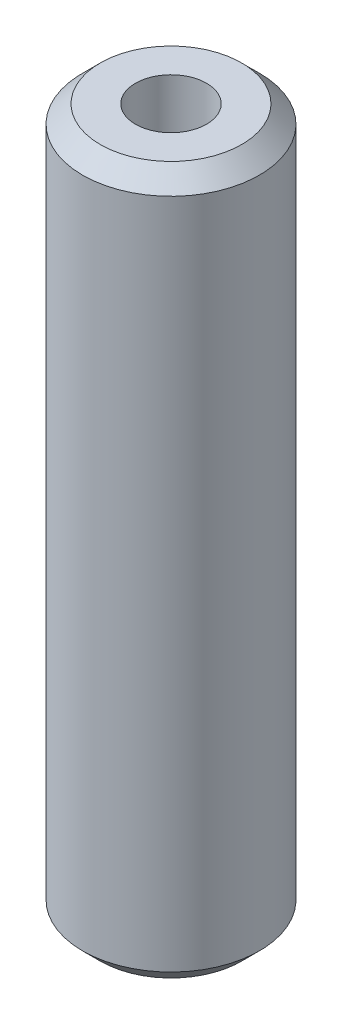
ISO-10303-21;
HEADER;
FILE_DESCRIPTION(('STEP AP214'),'2;1');
FILE_NAME('part.step','',(''),(''),'','','');
FILE_SCHEMA(('AUTOMOTIVE_DESIGN { 1 0 10303 214 1 1 1 1 }'));
ENDSEC;
DATA;
#1=APPLICATION_CONTEXT('core data for automotive mechanical design processes');
#2=APPLICATION_PROTOCOL_DEFINITION('international standard','automotive_design',2000,#1);
#3=PRODUCT_CONTEXT('',#1,'mechanical');
#4=PRODUCT('Part','Part','',(#3));
#5=PRODUCT_RELATED_PRODUCT_CATEGORY('part','',(#4));
#6=PRODUCT_DEFINITION_FORMATION('','',#4);
#7=PRODUCT_DEFINITION_CONTEXT('part definition',#1,'design');
#8=PRODUCT_DEFINITION('design','',#6,#7);
#9=PRODUCT_DEFINITION_SHAPE('','',#8);
#10=(LENGTH_UNIT() NAMED_UNIT(*) SI_UNIT(.MILLI.,.METRE.));
#11=(NAMED_UNIT(*) PLANE_ANGLE_UNIT() SI_UNIT($,.RADIAN.));
#12=(NAMED_UNIT(*) SI_UNIT($,.STERADIAN.) SOLID_ANGLE_UNIT());
#13=UNCERTAINTY_MEASURE_WITH_UNIT(LENGTH_MEASURE(1.E-05),#10,'distance_accuracy_value','');
#14=(GEOMETRIC_REPRESENTATION_CONTEXT(3) GLOBAL_UNCERTAINTY_ASSIGNED_CONTEXT((#13)) GLOBAL_UNIT_ASSIGNED_CONTEXT((#10,
#11,#12)) REPRESENTATION_CONTEXT('',''));
#15=CARTESIAN_POINT('',(0.,0.,0.));
#16=DIRECTION('',(0.,0.,1.));
#17=DIRECTION('',(1.,0.,0.));
#18=AXIS2_PLACEMENT_3D('',#15,#16,#17);
#19=CARTESIAN_POINT('',(0.,50.8,0.));
#20=DIRECTION('',(0.,-1.,0.));
#21=DIRECTION('',(0.,0.,-1.));
#22=AXIS2_PLACEMENT_3D('',#19,#20,#21);
#23=CYLINDRICAL_SURFACE('',#22,6.35);
#24=CARTESIAN_POINT('',(0.,1.27000000000001,0.));
#25=DIRECTION('',(0.,1.,0.));
#26=DIRECTION('',(0.,0.,1.));
#27=AXIS2_PLACEMENT_3D('',#24,#25,#26);
#28=CIRCLE('',#27,6.35);
#29=CARTESIAN_POINT('',(0.,1.27000000000001,6.35));
#30=VERTEX_POINT('',#29);
#31=EDGE_CURVE('E98',#30,#30,#28,.T.);
#32=ORIENTED_EDGE('',*,*,#31,.T.);
#33=EDGE_LOOP('',(#32));
#34=FACE_BOUND('',#33,.T.);
#35=CARTESIAN_POINT('',(0.,49.53,0.));
#36=DIRECTION('',(0.,1.,0.));
#37=DIRECTION('',(0.,0.,1.));
#38=AXIS2_PLACEMENT_3D('',#35,#36,#37);
#39=CIRCLE('',#38,6.35);
#40=CARTESIAN_POINT('',(0.,49.53,6.35));
#41=VERTEX_POINT('',#40);
#42=EDGE_CURVE('E94',#41,#41,#39,.F.);
#43=ORIENTED_EDGE('',*,*,#42,.T.);
#44=EDGE_LOOP('',(#43));
#45=FACE_BOUND('',#44,.T.);
#46=ADVANCED_FACE('F50',(#34,#45),#23,.T.);
#47=CARTESIAN_POINT('',(0.,50.8,0.));
#48=DIRECTION('',(0.,1.,0.));
#49=DIRECTION('',(0.,0.,1.));
#50=AXIS2_PLACEMENT_3D('',#47,#48,#49);
#51=PLANE('',#50);
#52=CARTESIAN_POINT('',(0.,50.8,0.));
#53=DIRECTION('',(0.,1.,0.));
#54=DIRECTION('',(0.,0.,1.));
#55=AXIS2_PLACEMENT_3D('',#52,#53,#54);
#56=CIRCLE('',#55,2.5527);
#57=CARTESIAN_POINT('',(0.,50.8,2.5527));
#58=VERTEX_POINT('',#57);
#59=EDGE_CURVE('E80',#58,#58,#56,.T.);
#60=ORIENTED_EDGE('',*,*,#59,.F.);
#61=EDGE_LOOP('',(#60));
#62=FACE_BOUND('',#61,.T.);
#63=CARTESIAN_POINT('',(0.,50.8,0.));
#64=DIRECTION('',(0.,1.,0.));
#65=DIRECTION('',(0.,0.,1.));
#66=AXIS2_PLACEMENT_3D('',#63,#64,#65);
#67=CIRCLE('',#66,5.08);
#68=CARTESIAN_POINT('',(0.,50.8,5.08));
#69=VERTEX_POINT('',#68);
#70=EDGE_CURVE('E12',#69,#69,#67,.T.);
#71=ORIENTED_EDGE('',*,*,#70,.T.);
#72=EDGE_LOOP('',(#71));
#73=FACE_BOUND('',#72,.T.);
#74=ADVANCED_FACE('F114',(#62,#73),#51,.T.);
#75=CARTESIAN_POINT('',(0.,0.,0.));
#76=DIRECTION('',(0.,1.,0.));
#77=DIRECTION('',(0.,0.,1.));
#78=AXIS2_PLACEMENT_3D('',#75,#76,#77);
#79=PLANE('',#78);
#80=CARTESIAN_POINT('',(0.,0.,0.));
#81=DIRECTION('',(0.,-1.,0.));
#82=DIRECTION('',(0.,0.,-1.));
#83=AXIS2_PLACEMENT_3D('',#80,#81,#82);
#84=CIRCLE('',#83,2.5527);
#85=CARTESIAN_POINT('',(0.,0.,-2.5527));
#86=VERTEX_POINT('',#85);
#87=EDGE_CURVE('E79',#86,#86,#84,.T.);
#88=ORIENTED_EDGE('',*,*,#87,.F.);
#89=EDGE_LOOP('',(#88));
#90=FACE_BOUND('',#89,.T.);
#91=CARTESIAN_POINT('',(0.,0.,0.));
#92=DIRECTION('',(0.,1.,0.));
#93=DIRECTION('',(0.,0.,1.));
#94=AXIS2_PLACEMENT_3D('',#91,#92,#93);
#95=CIRCLE('',#94,5.07999999999999);
#96=CARTESIAN_POINT('',(0.,0.,5.07999999999999));
#97=VERTEX_POINT('',#96);
#98=EDGE_CURVE('E60',#97,#97,#95,.F.);
#99=ORIENTED_EDGE('',*,*,#98,.T.);
#100=EDGE_LOOP('',(#99));
#101=FACE_BOUND('',#100,.T.);
#102=ADVANCED_FACE('F105',(#90,#101),#79,.F.);
#103=CARTESIAN_POINT('',(0.,1.27000000000001,0.));
#104=DIRECTION('',(0.,1.,0.));
#105=DIRECTION('',(0.,0.,1.));
#106=AXIS2_PLACEMENT_3D('',#103,#104,#105);
#107=CONICAL_SURFACE('',#106,6.35,0.78539816339745);
#108=ORIENTED_EDGE('',*,*,#98,.F.);
#109=EDGE_LOOP('',(#108));
#110=FACE_BOUND('',#109,.T.);
#111=ORIENTED_EDGE('',*,*,#31,.F.);
#112=EDGE_LOOP('',(#111));
#113=FACE_BOUND('',#112,.T.);
#114=ADVANCED_FACE('F107',(#110,#113),#107,.T.);
#115=CARTESIAN_POINT('',(0.,50.8,0.));
#116=DIRECTION('',(0.,-1.,0.));
#117=DIRECTION('',(0.,0.,-1.));
#118=AXIS2_PLACEMENT_3D('',#115,#116,#117);
#119=CONICAL_SURFACE('',#118,5.08,0.785398163397445);
#120=ORIENTED_EDGE('',*,*,#42,.F.);
#121=EDGE_LOOP('',(#120));
#122=FACE_BOUND('',#121,.T.);
#123=ORIENTED_EDGE('',*,*,#70,.F.);
#124=EDGE_LOOP('',(#123));
#125=FACE_BOUND('',#124,.T.);
#126=ADVANCED_FACE('F52',(#122,#125),#119,.T.);
#127=CARTESIAN_POINT('',(0.,16.51,0.));
#128=DIRECTION('',(0.,-1.,0.));
#129=DIRECTION('',(0.,0.,-1.));
#130=AXIS2_PLACEMENT_3D('',#127,#128,#129);
#131=CONICAL_SURFACE('',#130,2.55269999999999,1.02974425867665);
#132=CARTESIAN_POINT('',(0.,18.0438169021917,0.));
#133=VERTEX_POINT('',#132);
#134=VERTEX_LOOP('',#133);
#135=FACE_BOUND('',#134,.T.);
#136=CARTESIAN_POINT('',(0.,16.51,0.));
#137=DIRECTION('',(0.,-1.,0.));
#138=DIRECTION('',(0.,0.,-1.));
#139=AXIS2_PLACEMENT_3D('',#136,#137,#138);
#140=CIRCLE('',#139,2.55269999999999);
#141=CARTESIAN_POINT('',(0.,16.51,-2.55269999999999));
#142=VERTEX_POINT('',#141);
#143=EDGE_CURVE('E86',#142,#142,#140,.T.);
#144=ORIENTED_EDGE('',*,*,#143,.T.);
#145=EDGE_LOOP('',(#144));
#146=FACE_BOUND('',#145,.T.);
#147=ADVANCED_FACE('F120',(#135,#146),#131,.F.);
#148=CARTESIAN_POINT('',(0.,0.,0.));
#149=DIRECTION('',(0.,-1.,0.));
#150=DIRECTION('',(0.,0.,-1.));
#151=AXIS2_PLACEMENT_3D('',#148,#149,#150);
#152=CYLINDRICAL_SURFACE('',#151,2.5527);
#153=ORIENTED_EDGE('',*,*,#143,.F.);
#154=EDGE_LOOP('',(#153));
#155=FACE_BOUND('',#154,.T.);
#156=ORIENTED_EDGE('',*,*,#87,.T.);
#157=EDGE_LOOP('',(#156));
#158=FACE_BOUND('',#157,.T.);
#159=ADVANCED_FACE('F72',(#155,#158),#152,.F.);
#160=CARTESIAN_POINT('',(0.,34.29,0.));
#161=DIRECTION('',(0.,1.,0.));
#162=DIRECTION('',(0.,0.,1.));
#163=AXIS2_PLACEMENT_3D('',#160,#161,#162);
#164=CONICAL_SURFACE('',#163,2.55269999999999,1.02974425867665);
#165=CARTESIAN_POINT('',(0.,32.7561830978083,0.));
#166=VERTEX_POINT('',#165);
#167=VERTEX_LOOP('',#166);
#168=FACE_BOUND('',#167,.T.);
#169=CARTESIAN_POINT('',(0.,34.29,0.));
#170=DIRECTION('',(0.,1.,0.));
#171=DIRECTION('',(0.,0.,1.));
#172=AXIS2_PLACEMENT_3D('',#169,#170,#171);
#173=CIRCLE('',#172,2.55269999999999);
#174=CARTESIAN_POINT('',(0.,34.29,2.55269999999999));
#175=VERTEX_POINT('',#174);
#176=EDGE_CURVE('E76',#175,#175,#173,.T.);
#177=ORIENTED_EDGE('',*,*,#176,.T.);
#178=EDGE_LOOP('',(#177));
#179=FACE_BOUND('',#178,.T.);
#180=ADVANCED_FACE('F68',(#168,#179),#164,.F.);
#181=CARTESIAN_POINT('',(0.,50.8,0.));
#182=DIRECTION('',(0.,1.,0.));
#183=DIRECTION('',(0.,0.,1.));
#184=AXIS2_PLACEMENT_3D('',#181,#182,#183);
#185=CYLINDRICAL_SURFACE('',#184,2.5527);
#186=ORIENTED_EDGE('',*,*,#176,.F.);
#187=EDGE_LOOP('',(#186));
#188=FACE_BOUND('',#187,.T.);
#189=ORIENTED_EDGE('',*,*,#59,.T.);
#190=EDGE_LOOP('',(#189));
#191=FACE_BOUND('',#190,.T.);
#192=ADVANCED_FACE('F71',(#188,#191),#185,.F.);
#193=CLOSED_SHELL('',(#46,#74,#102,#114,#126,#147,#159,#180,#192));
#194=MANIFOLD_SOLID_BREP('B2',#193);
#195=ADVANCED_BREP_SHAPE_REPRESENTATION('',(#18,#194),#14);
#196=SHAPE_DEFINITION_REPRESENTATION(#9,#195);
ENDSEC;
END-ISO-10303-21;
